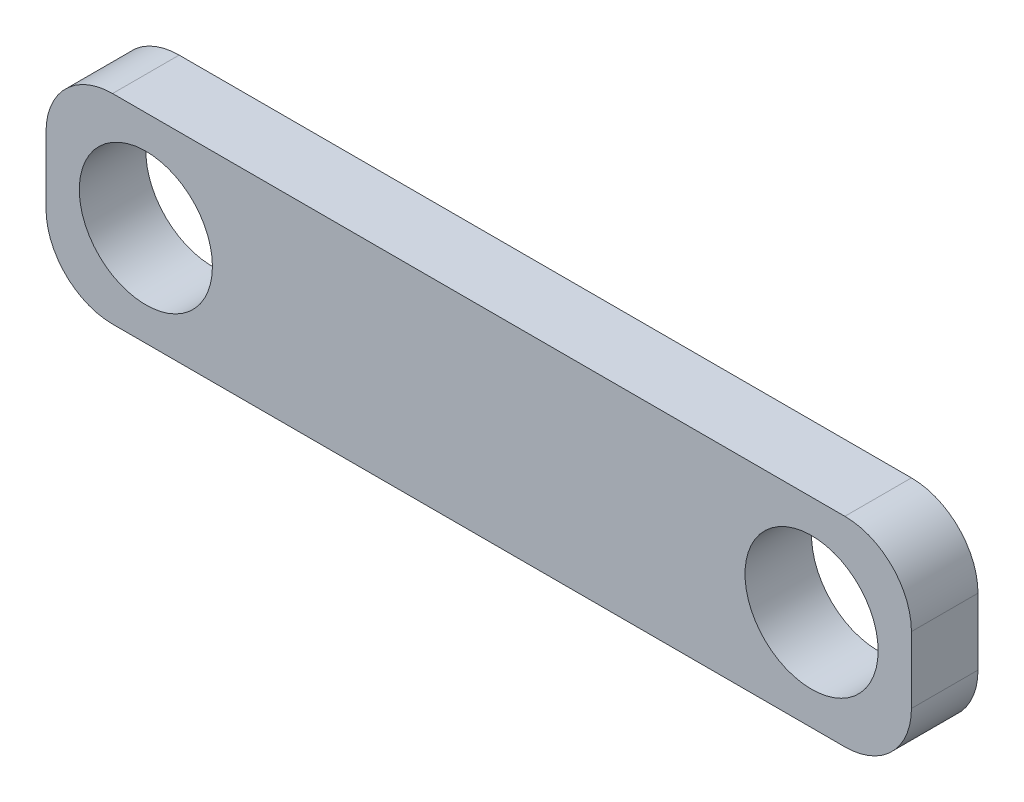
ISO-10303-21;
HEADER;
FILE_DESCRIPTION(('STEP AP214'),'2;1');
FILE_NAME('part.step','',(''),(''),'','','');
FILE_SCHEMA(('AUTOMOTIVE_DESIGN { 1 0 10303 214 1 1 1 1 }'));
ENDSEC;
DATA;
#1=APPLICATION_CONTEXT('core data for automotive mechanical design processes');
#2=APPLICATION_PROTOCOL_DEFINITION('international standard','automotive_design',2000,#1);
#3=PRODUCT_CONTEXT('',#1,'mechanical');
#4=PRODUCT('Part','Part','',(#3));
#5=PRODUCT_RELATED_PRODUCT_CATEGORY('part','',(#4));
#6=PRODUCT_DEFINITION_FORMATION('','',#4);
#7=PRODUCT_DEFINITION_CONTEXT('part definition',#1,'design');
#8=PRODUCT_DEFINITION('design','',#6,#7);
#9=PRODUCT_DEFINITION_SHAPE('','',#8);
#10=(LENGTH_UNIT() NAMED_UNIT(*) SI_UNIT(.MILLI.,.METRE.));
#11=(NAMED_UNIT(*) PLANE_ANGLE_UNIT() SI_UNIT($,.RADIAN.));
#12=(NAMED_UNIT(*) SI_UNIT($,.STERADIAN.) SOLID_ANGLE_UNIT());
#13=UNCERTAINTY_MEASURE_WITH_UNIT(LENGTH_MEASURE(1.E-05),#10,'distance_accuracy_value','');
#14=(GEOMETRIC_REPRESENTATION_CONTEXT(3) GLOBAL_UNCERTAINTY_ASSIGNED_CONTEXT((#13)) GLOBAL_UNIT_ASSIGNED_CONTEXT((#10,
#11,#12)) REPRESENTATION_CONTEXT('',''));
#15=CARTESIAN_POINT('',(0.,0.,0.));
#16=DIRECTION('',(0.,0.,1.));
#17=DIRECTION('',(1.,0.,0.));
#18=AXIS2_PLACEMENT_3D('',#15,#16,#17);
#19=CARTESIAN_POINT('',(55.,5.,5.));
#20=DIRECTION('',(0.,0.,-1.));
#21=DIRECTION('',(-1.,0.,0.));
#22=AXIS2_PLACEMENT_3D('',#19,#20,#21);
#23=PLANE('',#22);
#24=CARTESIAN_POINT('',(-50.,0.,5.));
#25=DIRECTION('',(0.,0.,1.));
#26=DIRECTION('',(1.,0.,0.));
#27=AXIS2_PLACEMENT_3D('',#24,#25,#26);
#28=CIRCLE('',#27,10.);
#29=CARTESIAN_POINT('',(-40.,0.,5.));
#30=VERTEX_POINT('',#29);
#31=EDGE_CURVE('E133',#30,#30,#28,.T.);
#32=ORIENTED_EDGE('',*,*,#31,.F.);
#33=EDGE_LOOP('',(#32));
#34=FACE_BOUND('',#33,.T.);
#35=CARTESIAN_POINT('',(55.,5.,5.));
#36=DIRECTION('',(0.,0.,1.));
#37=DIRECTION('',(-1.,0.,0.));
#38=AXIS2_PLACEMENT_3D('',#35,#36,#37);
#39=CIRCLE('',#38,10.);
#40=CARTESIAN_POINT('',(65.,4.99999999999993,5.));
#41=VERTEX_POINT('',#40);
#42=CARTESIAN_POINT('',(54.9999999999999,15.,5.));
#43=VERTEX_POINT('',#42);
#44=EDGE_CURVE('E144',#41,#43,#39,.T.);
#45=ORIENTED_EDGE('',*,*,#44,.T.);
#46=DIRECTION('',(-1.,0.,0.));
#47=VECTOR('',#46,1.);
#48=CARTESIAN_POINT('',(-54.9999999999999,15.,5.));
#49=LINE('',#48,#47);
#50=CARTESIAN_POINT('',(-54.9999999999999,15.,5.));
#51=VERTEX_POINT('',#50);
#52=EDGE_CURVE('E92',#43,#51,#49,.T.);
#53=ORIENTED_EDGE('',*,*,#52,.T.);
#54=CARTESIAN_POINT('',(-55.,5.,5.));
#55=DIRECTION('',(0.,0.,1.));
#56=DIRECTION('',(1.,0.,0.));
#57=AXIS2_PLACEMENT_3D('',#54,#55,#56);
#58=CIRCLE('',#57,10.);
#59=CARTESIAN_POINT('',(-65.,4.99999999999992,5.));
#60=VERTEX_POINT('',#59);
#61=EDGE_CURVE('E159',#51,#60,#58,.T.);
#62=ORIENTED_EDGE('',*,*,#61,.T.);
#63=DIRECTION('',(0.,-1.,0.));
#64=VECTOR('',#63,1.);
#65=CARTESIAN_POINT('',(-65.,4.99999999999992,5.));
#66=LINE('',#65,#64);
#67=CARTESIAN_POINT('',(-65.,-4.99999999999994,5.));
#68=VERTEX_POINT('',#67);
#69=EDGE_CURVE('E172',#60,#68,#66,.T.);
#70=ORIENTED_EDGE('',*,*,#69,.T.);
#71=CARTESIAN_POINT('',(-55.,-5.,5.));
#72=DIRECTION('',(0.,0.,1.));
#73=DIRECTION('',(-1.,0.,0.));
#74=AXIS2_PLACEMENT_3D('',#71,#72,#73);
#75=CIRCLE('',#74,10.);
#76=CARTESIAN_POINT('',(-54.9999999999999,-15.,5.));
#77=VERTEX_POINT('',#76);
#78=EDGE_CURVE('E111',#68,#77,#75,.T.);
#79=ORIENTED_EDGE('',*,*,#78,.T.);
#80=DIRECTION('',(1.,0.,0.));
#81=VECTOR('',#80,1.);
#82=CARTESIAN_POINT('',(-54.9999999999999,-15.,5.));
#83=LINE('',#82,#81);
#84=CARTESIAN_POINT('',(54.9999999999999,-15.,5.));
#85=VERTEX_POINT('',#84);
#86=EDGE_CURVE('E105',#77,#85,#83,.T.);
#87=ORIENTED_EDGE('',*,*,#86,.T.);
#88=CARTESIAN_POINT('',(55.,-5.,5.));
#89=DIRECTION('',(0.,0.,1.));
#90=DIRECTION('',(-1.,0.,0.));
#91=AXIS2_PLACEMENT_3D('',#88,#89,#90);
#92=CIRCLE('',#91,10.);
#93=CARTESIAN_POINT('',(65.,-4.99999999999993,5.));
#94=VERTEX_POINT('',#93);
#95=EDGE_CURVE('E109',#85,#94,#92,.T.);
#96=ORIENTED_EDGE('',*,*,#95,.T.);
#97=DIRECTION('',(0.,1.,0.));
#98=VECTOR('',#97,1.);
#99=CARTESIAN_POINT('',(65.,4.99999999999993,5.));
#100=LINE('',#99,#98);
#101=EDGE_CURVE('E49',#94,#41,#100,.T.);
#102=ORIENTED_EDGE('',*,*,#101,.T.);
#103=EDGE_LOOP('',(#45,#53,#62,#70,#79,#87,#96,#102));
#104=FACE_BOUND('',#103,.T.);
#105=CARTESIAN_POINT('',(50.,0.,5.));
#106=DIRECTION('',(0.,0.,1.));
#107=DIRECTION('',(1.,0.,0.));
#108=AXIS2_PLACEMENT_3D('',#105,#106,#107);
#109=CIRCLE('',#108,10.);
#110=CARTESIAN_POINT('',(60.,0.,5.));
#111=VERTEX_POINT('',#110);
#112=EDGE_CURVE('E181',#111,#111,#109,.T.);
#113=ORIENTED_EDGE('',*,*,#112,.F.);
#114=EDGE_LOOP('',(#113));
#115=FACE_BOUND('',#114,.T.);
#116=ADVANCED_FACE('F32',(#34,#104,#115),#23,.F.);
#117=CARTESIAN_POINT('',(55.,5.,-5.));
#118=DIRECTION('',(0.,0.,-1.));
#119=DIRECTION('',(-1.,0.,0.));
#120=AXIS2_PLACEMENT_3D('',#117,#118,#119);
#121=PLANE('',#120);
#122=CARTESIAN_POINT('',(-50.,0.,-5.));
#123=DIRECTION('',(0.,0.,1.));
#124=DIRECTION('',(1.,0.,0.));
#125=AXIS2_PLACEMENT_3D('',#122,#123,#124);
#126=CIRCLE('',#125,10.);
#127=CARTESIAN_POINT('',(-40.,0.,-5.));
#128=VERTEX_POINT('',#127);
#129=EDGE_CURVE('E178',#128,#128,#126,.T.);
#130=ORIENTED_EDGE('',*,*,#129,.T.);
#131=EDGE_LOOP('',(#130));
#132=FACE_BOUND('',#131,.T.);
#133=CARTESIAN_POINT('',(55.,5.,-5.));
#134=DIRECTION('',(0.,0.,1.));
#135=DIRECTION('',(-1.,0.,0.));
#136=AXIS2_PLACEMENT_3D('',#133,#134,#135);
#137=CIRCLE('',#136,10.);
#138=CARTESIAN_POINT('',(65.,4.99999999999993,-5.));
#139=VERTEX_POINT('',#138);
#140=CARTESIAN_POINT('',(54.9999999999999,15.,-5.));
#141=VERTEX_POINT('',#140);
#142=EDGE_CURVE('E129',#139,#141,#137,.T.);
#143=ORIENTED_EDGE('',*,*,#142,.F.);
#144=DIRECTION('',(0.,1.,0.));
#145=VECTOR('',#144,1.);
#146=CARTESIAN_POINT('',(65.,4.99999999999993,-5.));
#147=LINE('',#146,#145);
#148=CARTESIAN_POINT('',(65.,-4.99999999999993,-5.));
#149=VERTEX_POINT('',#148);
#150=EDGE_CURVE('E84',#149,#139,#147,.T.);
#151=ORIENTED_EDGE('',*,*,#150,.F.);
#152=CARTESIAN_POINT('',(55.,-5.,-5.));
#153=DIRECTION('',(0.,0.,1.));
#154=DIRECTION('',(-1.,0.,0.));
#155=AXIS2_PLACEMENT_3D('',#152,#153,#154);
#156=CIRCLE('',#155,10.);
#157=CARTESIAN_POINT('',(54.9999999999999,-15.,-5.));
#158=VERTEX_POINT('',#157);
#159=EDGE_CURVE('E78',#158,#149,#156,.T.);
#160=ORIENTED_EDGE('',*,*,#159,.F.);
#161=DIRECTION('',(1.,0.,0.));
#162=VECTOR('',#161,1.);
#163=CARTESIAN_POINT('',(-54.9999999999999,-15.,-5.));
#164=LINE('',#163,#162);
#165=CARTESIAN_POINT('',(-54.9999999999999,-15.,-5.));
#166=VERTEX_POINT('',#165);
#167=EDGE_CURVE('E119',#166,#158,#164,.T.);
#168=ORIENTED_EDGE('',*,*,#167,.F.);
#169=CARTESIAN_POINT('',(-55.,-5.,-5.));
#170=DIRECTION('',(0.,0.,1.));
#171=DIRECTION('',(-1.,0.,0.));
#172=AXIS2_PLACEMENT_3D('',#169,#170,#171);
#173=CIRCLE('',#172,10.);
#174=CARTESIAN_POINT('',(-65.,-4.99999999999994,-5.));
#175=VERTEX_POINT('',#174);
#176=EDGE_CURVE('E139',#175,#166,#173,.T.);
#177=ORIENTED_EDGE('',*,*,#176,.F.);
#178=DIRECTION('',(0.,-1.,0.));
#179=VECTOR('',#178,1.);
#180=CARTESIAN_POINT('',(-65.,4.99999999999992,-5.));
#181=LINE('',#180,#179);
#182=CARTESIAN_POINT('',(-65.,4.99999999999992,-5.));
#183=VERTEX_POINT('',#182);
#184=EDGE_CURVE('E137',#183,#175,#181,.T.);
#185=ORIENTED_EDGE('',*,*,#184,.F.);
#186=CARTESIAN_POINT('',(-55.,5.,-5.));
#187=DIRECTION('',(0.,0.,1.));
#188=DIRECTION('',(1.,0.,0.));
#189=AXIS2_PLACEMENT_3D('',#186,#187,#188);
#190=CIRCLE('',#189,10.);
#191=CARTESIAN_POINT('',(-54.9999999999999,15.,-5.));
#192=VERTEX_POINT('',#191);
#193=EDGE_CURVE('E135',#192,#183,#190,.T.);
#194=ORIENTED_EDGE('',*,*,#193,.F.);
#195=DIRECTION('',(-1.,0.,0.));
#196=VECTOR('',#195,1.);
#197=CARTESIAN_POINT('',(-54.9999999999999,15.,-5.));
#198=LINE('',#197,#196);
#199=EDGE_CURVE('E132',#141,#192,#198,.T.);
#200=ORIENTED_EDGE('',*,*,#199,.F.);
#201=EDGE_LOOP('',(#143,#151,#160,#168,#177,#185,#194,#200));
#202=FACE_BOUND('',#201,.T.);
#203=CARTESIAN_POINT('',(50.,0.,-5.));
#204=DIRECTION('',(0.,0.,1.));
#205=DIRECTION('',(1.,0.,0.));
#206=AXIS2_PLACEMENT_3D('',#203,#204,#205);
#207=CIRCLE('',#206,10.);
#208=CARTESIAN_POINT('',(60.,0.,-5.));
#209=VERTEX_POINT('',#208);
#210=EDGE_CURVE('E184',#209,#209,#207,.T.);
#211=ORIENTED_EDGE('',*,*,#210,.T.);
#212=EDGE_LOOP('',(#211));
#213=FACE_BOUND('',#212,.T.);
#214=ADVANCED_FACE('F163',(#132,#202,#213),#121,.T.);
#215=CARTESIAN_POINT('',(55.,5.,5.));
#216=DIRECTION('',(0.,0.,-1.));
#217=DIRECTION('',(-1.,0.,0.));
#218=AXIS2_PLACEMENT_3D('',#215,#216,#217);
#219=CYLINDRICAL_SURFACE('',#218,10.);
#220=ORIENTED_EDGE('',*,*,#142,.T.);
#221=DIRECTION('',(0.,0.,-1.));
#222=VECTOR('',#221,1.);
#223=CARTESIAN_POINT('',(54.9999999999999,15.,5.));
#224=LINE('',#223,#222);
#225=EDGE_CURVE('E11',#43,#141,#224,.T.);
#226=ORIENTED_EDGE('',*,*,#225,.F.);
#227=ORIENTED_EDGE('',*,*,#44,.F.);
#228=DIRECTION('',(0.,0.,-1.));
#229=VECTOR('',#228,1.);
#230=CARTESIAN_POINT('',(65.,4.99999999999993,5.));
#231=LINE('',#230,#229);
#232=EDGE_CURVE('E125',#41,#139,#231,.T.);
#233=ORIENTED_EDGE('',*,*,#232,.T.);
#234=EDGE_LOOP('',(#220,#226,#227,#233));
#235=FACE_BOUND('',#234,.T.);
#236=ADVANCED_FACE('F34',(#235),#219,.T.);
#237=CARTESIAN_POINT('',(-54.9999999999999,15.,5.));
#238=DIRECTION('',(0.,-1.,0.));
#239=DIRECTION('',(0.,0.,-1.));
#240=AXIS2_PLACEMENT_3D('',#237,#238,#239);
#241=PLANE('',#240);
#242=ORIENTED_EDGE('',*,*,#199,.T.);
#243=DIRECTION('',(0.,0.,-1.));
#244=VECTOR('',#243,1.);
#245=CARTESIAN_POINT('',(-54.9999999999999,15.,5.));
#246=LINE('',#245,#244);
#247=EDGE_CURVE('E41',#51,#192,#246,.T.);
#248=ORIENTED_EDGE('',*,*,#247,.F.);
#249=ORIENTED_EDGE('',*,*,#52,.F.);
#250=ORIENTED_EDGE('',*,*,#225,.T.);
#251=EDGE_LOOP('',(#242,#248,#249,#250));
#252=FACE_BOUND('',#251,.T.);
#253=ADVANCED_FACE('F217',(#252),#241,.F.);
#254=CARTESIAN_POINT('',(-55.,5.,5.));
#255=DIRECTION('',(0.,0.,-1.));
#256=DIRECTION('',(-1.,0.,0.));
#257=AXIS2_PLACEMENT_3D('',#254,#255,#256);
#258=CYLINDRICAL_SURFACE('',#257,10.);
#259=ORIENTED_EDGE('',*,*,#193,.T.);
#260=DIRECTION('',(0.,0.,-1.));
#261=VECTOR('',#260,1.);
#262=CARTESIAN_POINT('',(-65.,4.99999999999992,5.));
#263=LINE('',#262,#261);
#264=EDGE_CURVE('E151',#60,#183,#263,.T.);
#265=ORIENTED_EDGE('',*,*,#264,.F.);
#266=ORIENTED_EDGE('',*,*,#61,.F.);
#267=ORIENTED_EDGE('',*,*,#247,.T.);
#268=EDGE_LOOP('',(#259,#265,#266,#267));
#269=FACE_BOUND('',#268,.T.);
#270=ADVANCED_FACE('F157',(#269),#258,.T.);
#271=CARTESIAN_POINT('',(-65.,4.99999999999992,5.));
#272=DIRECTION('',(1.,0.,0.));
#273=DIRECTION('',(0.,0.,-1.));
#274=AXIS2_PLACEMENT_3D('',#271,#272,#273);
#275=PLANE('',#274);
#276=ORIENTED_EDGE('',*,*,#184,.T.);
#277=DIRECTION('',(0.,0.,-1.));
#278=VECTOR('',#277,1.);
#279=CARTESIAN_POINT('',(-65.,-4.99999999999994,5.));
#280=LINE('',#279,#278);
#281=EDGE_CURVE('E148',#68,#175,#280,.T.);
#282=ORIENTED_EDGE('',*,*,#281,.F.);
#283=ORIENTED_EDGE('',*,*,#69,.F.);
#284=ORIENTED_EDGE('',*,*,#264,.T.);
#285=EDGE_LOOP('',(#276,#282,#283,#284));
#286=FACE_BOUND('',#285,.T.);
#287=ADVANCED_FACE('F168',(#286),#275,.F.);
#288=CARTESIAN_POINT('',(-55.,-5.,5.));
#289=DIRECTION('',(0.,0.,-1.));
#290=DIRECTION('',(-1.,0.,0.));
#291=AXIS2_PLACEMENT_3D('',#288,#289,#290);
#292=CYLINDRICAL_SURFACE('',#291,10.);
#293=ORIENTED_EDGE('',*,*,#176,.T.);
#294=DIRECTION('',(0.,0.,-1.));
#295=VECTOR('',#294,1.);
#296=CARTESIAN_POINT('',(-54.9999999999999,-15.,5.));
#297=LINE('',#296,#295);
#298=EDGE_CURVE('E120',#77,#166,#297,.T.);
#299=ORIENTED_EDGE('',*,*,#298,.F.);
#300=ORIENTED_EDGE('',*,*,#78,.F.);
#301=ORIENTED_EDGE('',*,*,#281,.T.);
#302=EDGE_LOOP('',(#293,#299,#300,#301));
#303=FACE_BOUND('',#302,.T.);
#304=ADVANCED_FACE('F171',(#303),#292,.T.);
#305=CARTESIAN_POINT('',(-54.9999999999999,-15.,5.));
#306=DIRECTION('',(0.,1.,0.));
#307=DIRECTION('',(0.,0.,1.));
#308=AXIS2_PLACEMENT_3D('',#305,#306,#307);
#309=PLANE('',#308);
#310=ORIENTED_EDGE('',*,*,#167,.T.);
#311=DIRECTION('',(0.,0.,-1.));
#312=VECTOR('',#311,1.);
#313=CARTESIAN_POINT('',(54.9999999999999,-15.,5.));
#314=LINE('',#313,#312);
#315=EDGE_CURVE('E116',#85,#158,#314,.T.);
#316=ORIENTED_EDGE('',*,*,#315,.F.);
#317=ORIENTED_EDGE('',*,*,#86,.F.);
#318=ORIENTED_EDGE('',*,*,#298,.T.);
#319=EDGE_LOOP('',(#310,#316,#317,#318));
#320=FACE_BOUND('',#319,.T.);
#321=ADVANCED_FACE('F117',(#320),#309,.F.);
#322=CARTESIAN_POINT('',(55.,-5.,5.));
#323=DIRECTION('',(0.,0.,-1.));
#324=DIRECTION('',(-1.,0.,0.));
#325=AXIS2_PLACEMENT_3D('',#322,#323,#324);
#326=CYLINDRICAL_SURFACE('',#325,10.);
#327=ORIENTED_EDGE('',*,*,#159,.T.);
#328=DIRECTION('',(0.,0.,-1.));
#329=VECTOR('',#328,1.);
#330=CARTESIAN_POINT('',(65.,-4.99999999999993,5.));
#331=LINE('',#330,#329);
#332=EDGE_CURVE('E121',#94,#149,#331,.T.);
#333=ORIENTED_EDGE('',*,*,#332,.F.);
#334=ORIENTED_EDGE('',*,*,#95,.F.);
#335=ORIENTED_EDGE('',*,*,#315,.T.);
#336=EDGE_LOOP('',(#327,#333,#334,#335));
#337=FACE_BOUND('',#336,.T.);
#338=ADVANCED_FACE('F123',(#337),#326,.T.);
#339=CARTESIAN_POINT('',(65.,4.99999999999993,5.));
#340=DIRECTION('',(-1.,0.,0.));
#341=DIRECTION('',(0.,0.,1.));
#342=AXIS2_PLACEMENT_3D('',#339,#340,#341);
#343=PLANE('',#342);
#344=ORIENTED_EDGE('',*,*,#150,.T.);
#345=ORIENTED_EDGE('',*,*,#232,.F.);
#346=ORIENTED_EDGE('',*,*,#101,.F.);
#347=ORIENTED_EDGE('',*,*,#332,.T.);
#348=EDGE_LOOP('',(#344,#345,#346,#347));
#349=FACE_BOUND('',#348,.T.);
#350=ADVANCED_FACE('F205',(#349),#343,.F.);
#351=CARTESIAN_POINT('',(-50.,0.,5.));
#352=DIRECTION('',(0.,0.,-1.));
#353=DIRECTION('',(-1.,0.,0.));
#354=AXIS2_PLACEMENT_3D('',#351,#352,#353);
#355=CYLINDRICAL_SURFACE('',#354,10.);
#356=ORIENTED_EDGE('',*,*,#31,.T.);
#357=EDGE_LOOP('',(#356));
#358=FACE_BOUND('',#357,.T.);
#359=ORIENTED_EDGE('',*,*,#129,.F.);
#360=EDGE_LOOP('',(#359));
#361=FACE_BOUND('',#360,.T.);
#362=ADVANCED_FACE('F202',(#358,#361),#355,.F.);
#363=CARTESIAN_POINT('',(50.,0.,5.));
#364=DIRECTION('',(0.,0.,-1.));
#365=DIRECTION('',(-1.,0.,0.));
#366=AXIS2_PLACEMENT_3D('',#363,#364,#365);
#367=CYLINDRICAL_SURFACE('',#366,10.);
#368=ORIENTED_EDGE('',*,*,#112,.T.);
#369=EDGE_LOOP('',(#368));
#370=FACE_BOUND('',#369,.T.);
#371=ORIENTED_EDGE('',*,*,#210,.F.);
#372=EDGE_LOOP('',(#371));
#373=FACE_BOUND('',#372,.T.);
#374=ADVANCED_FACE('F190',(#370,#373),#367,.F.);
#375=CLOSED_SHELL('',(#116,#214,#236,#253,#270,#287,#304,#321,#338,#350,#362,#374));
#376=MANIFOLD_SOLID_BREP('B2',#375);
#377=ADVANCED_BREP_SHAPE_REPRESENTATION('',(#18,#376),#14);
#378=SHAPE_DEFINITION_REPRESENTATION(#9,#377);
ENDSEC;
END-ISO-10303-21;
